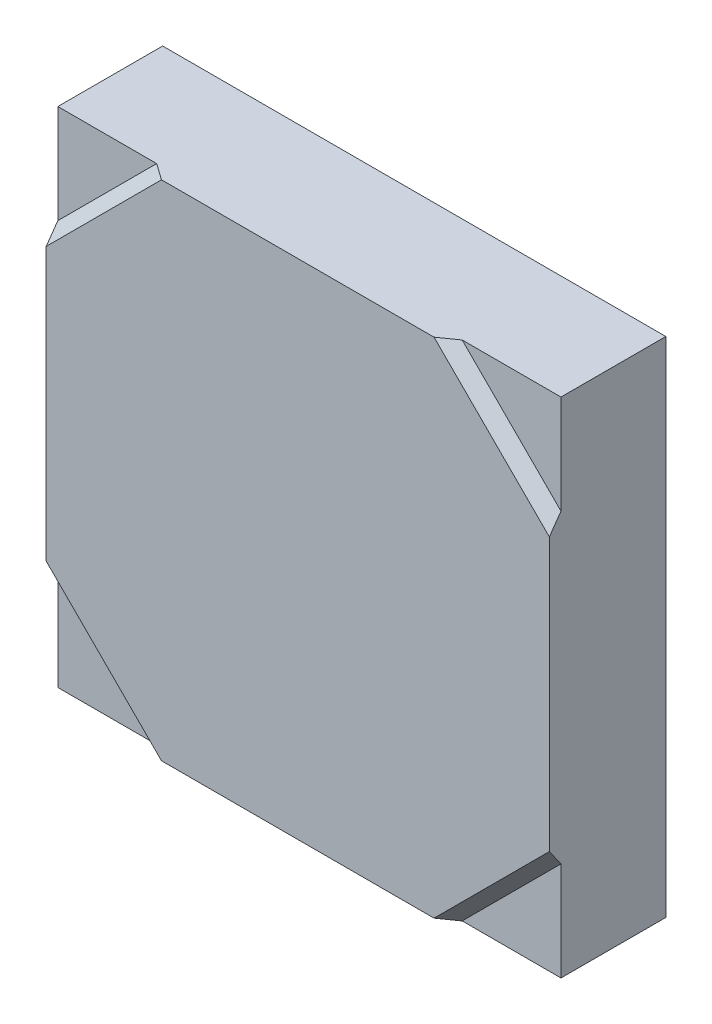
ISO-10303-21;
HEADER;
FILE_DESCRIPTION(('STEP AP214'),'2;1');
FILE_NAME('part.step','',(''),(''),'','','');
FILE_SCHEMA(('AUTOMOTIVE_DESIGN { 1 0 10303 214 1 1 1 1 }'));
ENDSEC;
DATA;
#1=APPLICATION_CONTEXT('core data for automotive mechanical design processes');
#2=APPLICATION_PROTOCOL_DEFINITION('international standard','automotive_design',2000,#1);
#3=PRODUCT_CONTEXT('',#1,'mechanical');
#4=PRODUCT('Part','Part','',(#3));
#5=PRODUCT_RELATED_PRODUCT_CATEGORY('part','',(#4));
#6=PRODUCT_DEFINITION_FORMATION('','',#4);
#7=PRODUCT_DEFINITION_CONTEXT('part definition',#1,'design');
#8=PRODUCT_DEFINITION('design','',#6,#7);
#9=PRODUCT_DEFINITION_SHAPE('','',#8);
#10=(LENGTH_UNIT() NAMED_UNIT(*) SI_UNIT(.MILLI.,.METRE.));
#11=(NAMED_UNIT(*) PLANE_ANGLE_UNIT() SI_UNIT($,.RADIAN.));
#12=(NAMED_UNIT(*) SI_UNIT($,.STERADIAN.) SOLID_ANGLE_UNIT());
#13=UNCERTAINTY_MEASURE_WITH_UNIT(LENGTH_MEASURE(1.E-05),#10,'distance_accuracy_value','');
#14=(GEOMETRIC_REPRESENTATION_CONTEXT(3) GLOBAL_UNCERTAINTY_ASSIGNED_CONTEXT((#13)) GLOBAL_UNIT_ASSIGNED_CONTEXT((#10,
#11,#12)) REPRESENTATION_CONTEXT('',''));
#15=CARTESIAN_POINT('',(0.,0.,0.));
#16=DIRECTION('',(0.,0.,1.));
#17=DIRECTION('',(1.,0.,0.));
#18=AXIS2_PLACEMENT_3D('',#15,#16,#17);
#19=CARTESIAN_POINT('',(-5.4,3.27867965644036,1.75));
#20=DIRECTION('',(-1.,0.,0.));
#21=DIRECTION('',(0.,0.,1.));
#22=AXIS2_PLACEMENT_3D('',#19,#20,#21);
#23=PLANE('',#22);
#24=DIRECTION('',(0.,-0.816496580927726,-0.577350269189626));
#25=VECTOR('',#24,1.);
#26=CARTESIAN_POINT('',(-5.4,-1.74107443490112,5.08725107893824));
#27=LINE('',#26,#25);
#28=CARTESIAN_POINT('',(-5.4,-2.92512626584708,4.25));
#29=VERTEX_POINT('',#28);
#30=CARTESIAN_POINT('',(-5.4,-3.27867965644035,4.));
#31=VERTEX_POINT('',#30);
#32=EDGE_CURVE('E237',#29,#31,#27,.T.);
#33=ORIENTED_EDGE('',*,*,#32,.F.);
#34=DIRECTION('',(0.,-1.,0.));
#35=VECTOR('',#34,1.);
#36=CARTESIAN_POINT('',(-5.4,5.4,4.25));
#37=LINE('',#36,#35);
#38=CARTESIAN_POINT('',(-5.4,2.92512626584708,4.25));
#39=VERTEX_POINT('',#38);
#40=EDGE_CURVE('E194',#39,#29,#37,.T.);
#41=ORIENTED_EDGE('',*,*,#40,.F.);
#42=DIRECTION('',(0.,-0.816496580927726,0.577350269189626));
#43=VECTOR('',#42,1.);
#44=CARTESIAN_POINT('',(-5.4,4.2804142631213,3.29166666666667));
#45=LINE('',#44,#43);
#46=CARTESIAN_POINT('',(-5.4,3.27867965644036,4.));
#47=VERTEX_POINT('',#46);
#48=EDGE_CURVE('E174',#47,#39,#45,.T.);
#49=ORIENTED_EDGE('',*,*,#48,.F.);
#50=DIRECTION('',(0.,-1.,0.));
#51=VECTOR('',#50,1.);
#52=CARTESIAN_POINT('',(-5.4,5.4,4.));
#53=LINE('',#52,#51);
#54=CARTESIAN_POINT('',(-5.4,5.4,4.));
#55=VERTEX_POINT('',#54);
#56=EDGE_CURVE('E186',#55,#47,#53,.T.);
#57=ORIENTED_EDGE('',*,*,#56,.F.);
#58=DIRECTION('',(0.,0.,1.));
#59=VECTOR('',#58,1.);
#60=CARTESIAN_POINT('',(-5.4,5.4,1.75));
#61=LINE('',#60,#59);
#62=CARTESIAN_POINT('',(-5.4,5.4,1.75));
#63=VERTEX_POINT('',#62);
#64=EDGE_CURVE('E212',#63,#55,#61,.T.);
#65=ORIENTED_EDGE('',*,*,#64,.F.);
#66=DIRECTION('',(0.,-1.,0.));
#67=VECTOR('',#66,1.);
#68=CARTESIAN_POINT('',(-5.4,5.4,1.75));
#69=LINE('',#68,#67);
#70=CARTESIAN_POINT('',(-5.4,-5.4,1.75));
#71=VERTEX_POINT('',#70);
#72=EDGE_CURVE('E199',#63,#71,#69,.T.);
#73=ORIENTED_EDGE('',*,*,#72,.T.);
#74=DIRECTION('',(0.,0.,1.));
#75=VECTOR('',#74,1.);
#76=CARTESIAN_POINT('',(-5.4,-5.4,1.75));
#77=LINE('',#76,#75);
#78=CARTESIAN_POINT('',(-5.4,-5.4,4.));
#79=VERTEX_POINT('',#78);
#80=EDGE_CURVE('E128',#71,#79,#77,.T.);
#81=ORIENTED_EDGE('',*,*,#80,.T.);
#82=DIRECTION('',(0.,-1.,0.));
#83=VECTOR('',#82,1.);
#84=CARTESIAN_POINT('',(-5.4,5.4,4.));
#85=LINE('',#84,#83);
#86=EDGE_CURVE('E204',#31,#79,#85,.T.);
#87=ORIENTED_EDGE('',*,*,#86,.F.);
#88=EDGE_LOOP('',(#33,#41,#49,#57,#65,#73,#81,#87));
#89=FACE_BOUND('',#88,.T.);
#90=ADVANCED_FACE('F16',(#89),#23,.T.);
#91=CARTESIAN_POINT('',(5.4,-3.27867965644036,1.75));
#92=DIRECTION('',(1.,0.,0.));
#93=DIRECTION('',(0.,-1.,0.));
#94=AXIS2_PLACEMENT_3D('',#91,#92,#93);
#95=PLANE('',#94);
#96=DIRECTION('',(0.,0.816496580927725,0.577350269189627));
#97=VECTOR('',#96,1.);
#98=CARTESIAN_POINT('',(5.4,-4.2804142631213,3.29166666666666));
#99=LINE('',#98,#97);
#100=CARTESIAN_POINT('',(5.4,-3.27867965644036,4.));
#101=VERTEX_POINT('',#100);
#102=CARTESIAN_POINT('',(5.4,-2.92512626584709,4.25));
#103=VERTEX_POINT('',#102);
#104=EDGE_CURVE('E27',#101,#103,#99,.T.);
#105=ORIENTED_EDGE('',*,*,#104,.F.);
#106=DIRECTION('',(0.,1.,0.));
#107=VECTOR('',#106,1.);
#108=CARTESIAN_POINT('',(5.4,-5.4,4.));
#109=LINE('',#108,#107);
#110=CARTESIAN_POINT('',(5.4,-5.4,4.));
#111=VERTEX_POINT('',#110);
#112=EDGE_CURVE('E205',#111,#101,#109,.T.);
#113=ORIENTED_EDGE('',*,*,#112,.F.);
#114=DIRECTION('',(0.,0.,1.));
#115=VECTOR('',#114,1.);
#116=CARTESIAN_POINT('',(5.4,-5.4,1.75));
#117=LINE('',#116,#115);
#118=CARTESIAN_POINT('',(5.4,-5.4,1.75));
#119=VERTEX_POINT('',#118);
#120=EDGE_CURVE('E137',#119,#111,#117,.T.);
#121=ORIENTED_EDGE('',*,*,#120,.F.);
#122=DIRECTION('',(0.,1.,0.));
#123=VECTOR('',#122,1.);
#124=CARTESIAN_POINT('',(5.4,-5.4,1.75));
#125=LINE('',#124,#123);
#126=CARTESIAN_POINT('',(5.4,5.4,1.75));
#127=VERTEX_POINT('',#126);
#128=EDGE_CURVE('E200',#119,#127,#125,.T.);
#129=ORIENTED_EDGE('',*,*,#128,.T.);
#130=DIRECTION('',(0.,0.,1.));
#131=VECTOR('',#130,1.);
#132=CARTESIAN_POINT('',(5.4,5.4,1.75));
#133=LINE('',#132,#131);
#134=CARTESIAN_POINT('',(5.4,5.4,4.));
#135=VERTEX_POINT('',#134);
#136=EDGE_CURVE('E213',#127,#135,#133,.T.);
#137=ORIENTED_EDGE('',*,*,#136,.T.);
#138=DIRECTION('',(0.,1.,0.));
#139=VECTOR('',#138,1.);
#140=CARTESIAN_POINT('',(5.4,-5.4,4.));
#141=LINE('',#140,#139);
#142=CARTESIAN_POINT('',(5.4,3.27867965644035,4.));
#143=VERTEX_POINT('',#142);
#144=EDGE_CURVE('E235',#143,#135,#141,.T.);
#145=ORIENTED_EDGE('',*,*,#144,.F.);
#146=DIRECTION('',(0.,0.816496580927725,-0.577350269189627));
#147=VECTOR('',#146,1.);
#148=CARTESIAN_POINT('',(5.4,1.74107443490112,5.08725107893824));
#149=LINE('',#148,#147);
#150=CARTESIAN_POINT('',(5.4,2.92512626584708,4.25));
#151=VERTEX_POINT('',#150);
#152=EDGE_CURVE('E11',#151,#143,#149,.T.);
#153=ORIENTED_EDGE('',*,*,#152,.F.);
#154=DIRECTION('',(0.,1.,0.));
#155=VECTOR('',#154,1.);
#156=CARTESIAN_POINT('',(5.4,-5.4,4.25));
#157=LINE('',#156,#155);
#158=EDGE_CURVE('E223',#103,#151,#157,.T.);
#159=ORIENTED_EDGE('',*,*,#158,.F.);
#160=EDGE_LOOP('',(#105,#113,#121,#129,#137,#145,#153,#159));
#161=FACE_BOUND('',#160,.T.);
#162=ADVANCED_FACE('F298',(#161),#95,.T.);
#163=CARTESIAN_POINT('',(4.78128156646177,3.72062139468195,4.125));
#164=DIRECTION('',(0.5,0.5,0.707106781186547));
#165=DIRECTION('',(0.707106781186548,-0.707106781186548,0.));
#166=AXIS2_PLACEMENT_3D('',#163,#164,#165);
#167=PLANE('',#166);
#168=DIRECTION('',(-0.816496580927725,0.,0.577350269189628));
#169=VECTOR('',#168,1.);
#170=CARTESIAN_POINT('',(4.2804142631213,5.4,3.29166666666666));
#171=LINE('',#170,#169);
#172=CARTESIAN_POINT('',(3.27867965644036,5.4,4.));
#173=VERTEX_POINT('',#172);
#174=CARTESIAN_POINT('',(2.92512626584709,5.4,4.25));
#175=VERTEX_POINT('',#174);
#176=EDGE_CURVE('E157',#173,#175,#171,.T.);
#177=ORIENTED_EDGE('',*,*,#176,.T.);
#178=DIRECTION('',(0.707106781186547,-0.707106781186548,0.));
#179=VECTOR('',#178,1.);
#180=CARTESIAN_POINT('',(4.69289321881346,3.63223304703363,4.25));
#181=LINE('',#180,#179);
#182=EDGE_CURVE('E152',#175,#151,#181,.T.);
#183=ORIENTED_EDGE('',*,*,#182,.T.);
#184=ORIENTED_EDGE('',*,*,#152,.T.);
#185=DIRECTION('',(-0.707106781186547,0.707106781186548,0.));
#186=VECTOR('',#185,1.);
#187=CARTESIAN_POINT('',(4.86966991411009,3.80900974233027,4.));
#188=LINE('',#187,#186);
#189=EDGE_CURVE('E188',#143,#173,#188,.T.);
#190=ORIENTED_EDGE('',*,*,#189,.T.);
#191=EDGE_LOOP('',(#177,#183,#184,#190));
#192=FACE_BOUND('',#191,.T.);
#193=ADVANCED_FACE('F577',(#192),#167,.T.);
#194=CARTESIAN_POINT('',(3.72062139468195,-4.78128156646177,4.125));
#195=DIRECTION('',(0.5,-0.5,0.707106781186547));
#196=DIRECTION('',(-0.707106781186548,-0.707106781186548,0.));
#197=AXIS2_PLACEMENT_3D('',#194,#195,#196);
#198=PLANE('',#197);
#199=ORIENTED_EDGE('',*,*,#104,.T.);
#200=DIRECTION('',(-0.707106781186548,-0.707106781186547,0.));
#201=VECTOR('',#200,1.);
#202=CARTESIAN_POINT('',(3.63223304703363,-4.69289321881346,4.25));
#203=LINE('',#202,#201);
#204=CARTESIAN_POINT('',(2.92512626584708,-5.4,4.25));
#205=VERTEX_POINT('',#204);
#206=EDGE_CURVE('E231',#103,#205,#203,.T.);
#207=ORIENTED_EDGE('',*,*,#206,.T.);
#208=DIRECTION('',(0.816496580927725,0.,-0.577350269189627));
#209=VECTOR('',#208,1.);
#210=CARTESIAN_POINT('',(1.74107443490112,-5.4,5.08725107893824));
#211=LINE('',#210,#209);
#212=CARTESIAN_POINT('',(3.27867965644035,-5.4,4.));
#213=VERTEX_POINT('',#212);
#214=EDGE_CURVE('E193',#205,#213,#211,.T.);
#215=ORIENTED_EDGE('',*,*,#214,.T.);
#216=DIRECTION('',(0.707106781186548,0.707106781186547,0.));
#217=VECTOR('',#216,1.);
#218=CARTESIAN_POINT('',(3.80900974233027,-4.86966991411009,4.));
#219=LINE('',#218,#217);
#220=EDGE_CURVE('E201',#213,#101,#219,.T.);
#221=ORIENTED_EDGE('',*,*,#220,.T.);
#222=EDGE_LOOP('',(#199,#207,#215,#221));
#223=FACE_BOUND('',#222,.T.);
#224=ADVANCED_FACE('F599',(#223),#198,.T.);
#225=CARTESIAN_POINT('',(-4.33933982822018,-4.33933982822018,4.));
#226=DIRECTION('',(0.,0.,1.));
#227=DIRECTION('',(1.,0.,0.));
#228=AXIS2_PLACEMENT_3D('',#225,#226,#227);
#229=PLANE('',#228);
#230=DIRECTION('',(1.,0.,0.));
#231=VECTOR('',#230,1.);
#232=CARTESIAN_POINT('',(-5.4,-5.4,4.));
#233=LINE('',#232,#231);
#234=CARTESIAN_POINT('',(-3.27867965644036,-5.4,4.));
#235=VERTEX_POINT('',#234);
#236=EDGE_CURVE('E247',#79,#235,#233,.T.);
#237=ORIENTED_EDGE('',*,*,#236,.T.);
#238=DIRECTION('',(0.707106781186547,-0.707106781186548,0.));
#239=VECTOR('',#238,1.);
#240=CARTESIAN_POINT('',(-4.86966991411009,-3.80900974233027,4.));
#241=LINE('',#240,#239);
#242=EDGE_CURVE('E158',#31,#235,#241,.T.);
#243=ORIENTED_EDGE('',*,*,#242,.F.);
#244=ORIENTED_EDGE('',*,*,#86,.T.);
#245=EDGE_LOOP('',(#237,#243,#244));
#246=FACE_BOUND('',#245,.T.);
#247=ADVANCED_FACE('F18',(#246),#229,.T.);
#248=CARTESIAN_POINT('',(4.33933982822018,-4.33933982822018,4.));
#249=DIRECTION('',(0.,0.,1.));
#250=DIRECTION('',(1.,0.,0.));
#251=AXIS2_PLACEMENT_3D('',#248,#249,#250);
#252=PLANE('',#251);
#253=ORIENTED_EDGE('',*,*,#112,.T.);
#254=ORIENTED_EDGE('',*,*,#220,.F.);
#255=DIRECTION('',(1.,0.,0.));
#256=VECTOR('',#255,1.);
#257=CARTESIAN_POINT('',(-5.4,-5.4,4.));
#258=LINE('',#257,#256);
#259=EDGE_CURVE('E189',#213,#111,#258,.T.);
#260=ORIENTED_EDGE('',*,*,#259,.T.);
#261=EDGE_LOOP('',(#253,#254,#260));
#262=FACE_BOUND('',#261,.T.);
#263=ADVANCED_FACE('F290',(#262),#252,.T.);
#264=CARTESIAN_POINT('',(4.33933982822018,4.33933982822018,4.));
#265=DIRECTION('',(0.,0.,1.));
#266=DIRECTION('',(1.,0.,0.));
#267=AXIS2_PLACEMENT_3D('',#264,#265,#266);
#268=PLANE('',#267);
#269=DIRECTION('',(-1.,0.,0.));
#270=VECTOR('',#269,1.);
#271=CARTESIAN_POINT('',(5.4,5.4,4.));
#272=LINE('',#271,#270);
#273=EDGE_CURVE('E20',#135,#173,#272,.T.);
#274=ORIENTED_EDGE('',*,*,#273,.T.);
#275=ORIENTED_EDGE('',*,*,#189,.F.);
#276=ORIENTED_EDGE('',*,*,#144,.T.);
#277=EDGE_LOOP('',(#274,#275,#276));
#278=FACE_BOUND('',#277,.T.);
#279=ADVANCED_FACE('F568',(#278),#268,.T.);
#280=CARTESIAN_POINT('',(-4.33933982822018,4.33933982822018,4.));
#281=DIRECTION('',(0.,0.,1.));
#282=DIRECTION('',(1.,0.,0.));
#283=AXIS2_PLACEMENT_3D('',#280,#281,#282);
#284=PLANE('',#283);
#285=ORIENTED_EDGE('',*,*,#56,.T.);
#286=DIRECTION('',(-0.707106781186548,-0.707106781186547,0.));
#287=VECTOR('',#286,1.);
#288=CARTESIAN_POINT('',(-3.80900974233027,4.86966991411009,4.));
#289=LINE('',#288,#287);
#290=CARTESIAN_POINT('',(-3.27867965644036,5.4,4.));
#291=VERTEX_POINT('',#290);
#292=EDGE_CURVE('E170',#291,#47,#289,.T.);
#293=ORIENTED_EDGE('',*,*,#292,.F.);
#294=DIRECTION('',(-1.,0.,0.));
#295=VECTOR('',#294,1.);
#296=CARTESIAN_POINT('',(5.4,5.4,4.));
#297=LINE('',#296,#295);
#298=EDGE_CURVE('E165',#291,#55,#297,.T.);
#299=ORIENTED_EDGE('',*,*,#298,.T.);
#300=EDGE_LOOP('',(#285,#293,#299));
#301=FACE_BOUND('',#300,.T.);
#302=ADVANCED_FACE('F564',(#301),#284,.T.);
#303=CARTESIAN_POINT('',(-3.27867965644036,-5.4,1.75));
#304=DIRECTION('',(0.,-1.,0.));
#305=DIRECTION('',(0.,0.,-1.));
#306=AXIS2_PLACEMENT_3D('',#303,#304,#305);
#307=PLANE('',#306);
#308=ORIENTED_EDGE('',*,*,#214,.F.);
#309=DIRECTION('',(1.,0.,0.));
#310=VECTOR('',#309,1.);
#311=CARTESIAN_POINT('',(-5.4,-5.4,4.25));
#312=LINE('',#311,#310);
#313=CARTESIAN_POINT('',(-2.92512626584709,-5.4,4.25));
#314=VERTEX_POINT('',#313);
#315=EDGE_CURVE('E190',#314,#205,#312,.T.);
#316=ORIENTED_EDGE('',*,*,#315,.F.);
#317=DIRECTION('',(0.816496580927725,0.,0.577350269189627));
#318=VECTOR('',#317,1.);
#319=CARTESIAN_POINT('',(-4.2804142631213,-5.4,3.29166666666667));
#320=LINE('',#319,#318);
#321=EDGE_CURVE('E243',#235,#314,#320,.T.);
#322=ORIENTED_EDGE('',*,*,#321,.F.);
#323=ORIENTED_EDGE('',*,*,#236,.F.);
#324=ORIENTED_EDGE('',*,*,#80,.F.);
#325=DIRECTION('',(1.,0.,0.));
#326=VECTOR('',#325,1.);
#327=CARTESIAN_POINT('',(-5.4,-5.4,1.75));
#328=LINE('',#327,#326);
#329=EDGE_CURVE('E196',#71,#119,#328,.T.);
#330=ORIENTED_EDGE('',*,*,#329,.T.);
#331=ORIENTED_EDGE('',*,*,#120,.T.);
#332=ORIENTED_EDGE('',*,*,#259,.F.);
#333=EDGE_LOOP('',(#308,#316,#322,#323,#324,#330,#331,#332));
#334=FACE_BOUND('',#333,.T.);
#335=ADVANCED_FACE('F291',(#334),#307,.T.);
#336=CARTESIAN_POINT('',(0.,0.,4.25));
#337=DIRECTION('',(0.,0.,1.));
#338=DIRECTION('',(1.,0.,0.));
#339=AXIS2_PLACEMENT_3D('',#336,#337,#338);
#340=PLANE('',#339);
#341=ORIENTED_EDGE('',*,*,#206,.F.);
#342=ORIENTED_EDGE('',*,*,#158,.T.);
#343=ORIENTED_EDGE('',*,*,#182,.F.);
#344=DIRECTION('',(-1.,0.,0.));
#345=VECTOR('',#344,1.);
#346=CARTESIAN_POINT('',(5.4,5.4,4.25));
#347=LINE('',#346,#345);
#348=CARTESIAN_POINT('',(-2.92512626584708,5.4,4.25));
#349=VERTEX_POINT('',#348);
#350=EDGE_CURVE('E143',#175,#349,#347,.T.);
#351=ORIENTED_EDGE('',*,*,#350,.T.);
#352=DIRECTION('',(0.707106781186548,0.707106781186547,0.));
#353=VECTOR('',#352,1.);
#354=CARTESIAN_POINT('',(-3.63223304703363,4.69289321881345,4.25));
#355=LINE('',#354,#353);
#356=EDGE_CURVE('E148',#39,#349,#355,.T.);
#357=ORIENTED_EDGE('',*,*,#356,.F.);
#358=ORIENTED_EDGE('',*,*,#40,.T.);
#359=DIRECTION('',(-0.707106781186547,0.707106781186548,0.));
#360=VECTOR('',#359,1.);
#361=CARTESIAN_POINT('',(-4.69289321881345,-3.63223304703363,4.25));
#362=LINE('',#361,#360);
#363=EDGE_CURVE('E240',#314,#29,#362,.T.);
#364=ORIENTED_EDGE('',*,*,#363,.F.);
#365=ORIENTED_EDGE('',*,*,#315,.T.);
#366=EDGE_LOOP('',(#341,#342,#343,#351,#357,#358,#364,#365));
#367=FACE_BOUND('',#366,.T.);
#368=ADVANCED_FACE('F146',(#367),#340,.T.);
#369=CARTESIAN_POINT('',(0.,0.,1.75));
#370=DIRECTION('',(0.,0.,1.));
#371=DIRECTION('',(1.,0.,0.));
#372=AXIS2_PLACEMENT_3D('',#369,#370,#371);
#373=PLANE('',#372);
#374=ORIENTED_EDGE('',*,*,#128,.F.);
#375=ORIENTED_EDGE('',*,*,#329,.F.);
#376=ORIENTED_EDGE('',*,*,#72,.F.);
#377=DIRECTION('',(-1.,0.,0.));
#378=VECTOR('',#377,1.);
#379=CARTESIAN_POINT('',(5.4,5.4,1.75));
#380=LINE('',#379,#378);
#381=EDGE_CURVE('E208',#127,#63,#380,.T.);
#382=ORIENTED_EDGE('',*,*,#381,.F.);
#383=EDGE_LOOP('',(#374,#375,#376,#382));
#384=FACE_BOUND('',#383,.T.);
#385=ADVANCED_FACE('F296',(#384),#373,.F.);
#386=CARTESIAN_POINT('',(3.27867965644036,5.4,1.75));
#387=DIRECTION('',(0.,1.,0.));
#388=DIRECTION('',(1.,0.,0.));
#389=AXIS2_PLACEMENT_3D('',#386,#387,#388);
#390=PLANE('',#389);
#391=DIRECTION('',(-0.816496580927727,0.,-0.577350269189625));
#392=VECTOR('',#391,1.);
#393=CARTESIAN_POINT('',(-1.74107443490112,5.4,5.08725107893824));
#394=LINE('',#393,#392);
#395=EDGE_CURVE('E161',#349,#291,#394,.T.);
#396=ORIENTED_EDGE('',*,*,#395,.F.);
#397=ORIENTED_EDGE('',*,*,#350,.F.);
#398=ORIENTED_EDGE('',*,*,#176,.F.);
#399=ORIENTED_EDGE('',*,*,#273,.F.);
#400=ORIENTED_EDGE('',*,*,#136,.F.);
#401=ORIENTED_EDGE('',*,*,#381,.T.);
#402=ORIENTED_EDGE('',*,*,#64,.T.);
#403=ORIENTED_EDGE('',*,*,#298,.F.);
#404=EDGE_LOOP('',(#396,#397,#398,#399,#400,#401,#402,#403));
#405=FACE_BOUND('',#404,.T.);
#406=ADVANCED_FACE('F162',(#405),#390,.T.);
#407=CARTESIAN_POINT('',(-4.78128156646177,-3.72062139468195,4.125));
#408=DIRECTION('',(-0.5,-0.5,0.707106781186547));
#409=DIRECTION('',(-0.707106781186548,0.707106781186548,0.));
#410=AXIS2_PLACEMENT_3D('',#407,#408,#409);
#411=PLANE('',#410);
#412=ORIENTED_EDGE('',*,*,#321,.T.);
#413=ORIENTED_EDGE('',*,*,#363,.T.);
#414=ORIENTED_EDGE('',*,*,#32,.T.);
#415=ORIENTED_EDGE('',*,*,#242,.T.);
#416=EDGE_LOOP('',(#412,#413,#414,#415));
#417=FACE_BOUND('',#416,.T.);
#418=ADVANCED_FACE('F607',(#417),#411,.T.);
#419=CARTESIAN_POINT('',(-3.72062139468195,4.78128156646177,4.125));
#420=DIRECTION('',(-0.5,0.5,0.707106781186548));
#421=DIRECTION('',(0.707106781186548,0.707106781186548,0.));
#422=AXIS2_PLACEMENT_3D('',#419,#420,#421);
#423=PLANE('',#422);
#424=ORIENTED_EDGE('',*,*,#48,.T.);
#425=ORIENTED_EDGE('',*,*,#356,.T.);
#426=ORIENTED_EDGE('',*,*,#395,.T.);
#427=ORIENTED_EDGE('',*,*,#292,.T.);
#428=EDGE_LOOP('',(#424,#425,#426,#427));
#429=FACE_BOUND('',#428,.T.);
#430=ADVANCED_FACE('F172',(#429),#423,.T.);
#431=CLOSED_SHELL('',(#90,#162,#193,#224,#247,#263,#279,#302,#335,#368,#385,#406,#418,#430));
#432=MANIFOLD_SOLID_BREP('B1',#431);
#433=ADVANCED_BREP_SHAPE_REPRESENTATION('',(#18,#432),#14);
#434=SHAPE_DEFINITION_REPRESENTATION(#9,#433);
ENDSEC;
END-ISO-10303-21;
